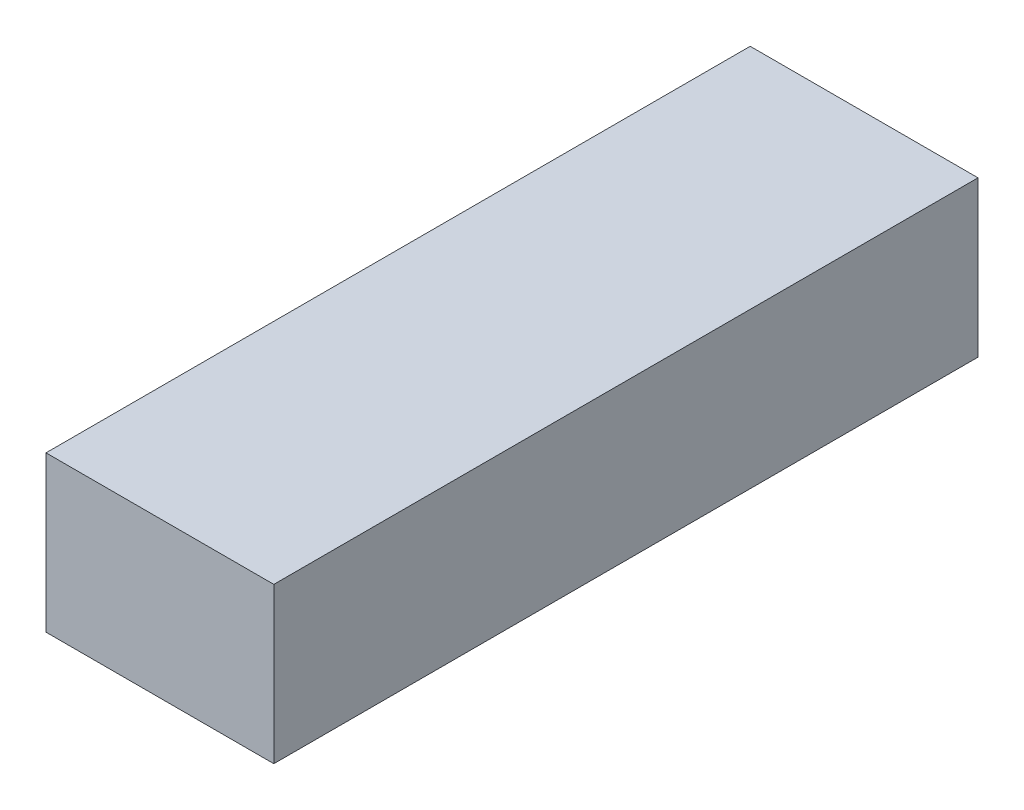
ISO-10303-21;
HEADER;
FILE_DESCRIPTION(('STEP AP214'),'2;1');
FILE_NAME('part.step','',(''),(''),'','','');
FILE_SCHEMA(('AUTOMOTIVE_DESIGN { 1 0 10303 214 1 1 1 1 }'));
ENDSEC;
DATA;
#1=APPLICATION_CONTEXT('core data for automotive mechanical design processes');
#2=APPLICATION_PROTOCOL_DEFINITION('international standard','automotive_design',2000,#1);
#3=PRODUCT_CONTEXT('',#1,'mechanical');
#4=PRODUCT('Part','Part','',(#3));
#5=PRODUCT_RELATED_PRODUCT_CATEGORY('part','',(#4));
#6=PRODUCT_DEFINITION_FORMATION('','',#4);
#7=PRODUCT_DEFINITION_CONTEXT('part definition',#1,'design');
#8=PRODUCT_DEFINITION('design','',#6,#7);
#9=PRODUCT_DEFINITION_SHAPE('','',#8);
#10=(LENGTH_UNIT() NAMED_UNIT(*) SI_UNIT(.MILLI.,.METRE.));
#11=(NAMED_UNIT(*) PLANE_ANGLE_UNIT() SI_UNIT($,.RADIAN.));
#12=(NAMED_UNIT(*) SI_UNIT($,.STERADIAN.) SOLID_ANGLE_UNIT());
#13=UNCERTAINTY_MEASURE_WITH_UNIT(LENGTH_MEASURE(1.E-05),#10,'distance_accuracy_value','');
#14=(GEOMETRIC_REPRESENTATION_CONTEXT(3) GLOBAL_UNCERTAINTY_ASSIGNED_CONTEXT((#13)) GLOBAL_UNIT_ASSIGNED_CONTEXT((#10,
#11,#12)) REPRESENTATION_CONTEXT('',''));
#15=CARTESIAN_POINT('',(0.,0.,0.));
#16=DIRECTION('',(0.,0.,1.));
#17=DIRECTION('',(1.,0.,0.));
#18=AXIS2_PLACEMENT_3D('',#15,#16,#17);
#19=CARTESIAN_POINT('',(-21.1619047619048,30.,87.6));
#20=DIRECTION('',(1.,0.,0.));
#21=DIRECTION('',(0.,0.,-1.));
#22=AXIS2_PLACEMENT_3D('',#19,#20,#21);
#23=PLANE('',#22);
#24=DIRECTION('',(0.,0.,1.));
#25=VECTOR('',#24,1.);
#26=CARTESIAN_POINT('',(-21.1619047619048,0.,87.6));
#27=LINE('',#26,#25);
#28=CARTESIAN_POINT('',(-21.1619047619048,0.,-48.4));
#29=VERTEX_POINT('',#28);
#30=CARTESIAN_POINT('',(-21.1619047619048,0.,87.6));
#31=VERTEX_POINT('',#30);
#32=EDGE_CURVE('E109',#29,#31,#27,.T.);
#33=ORIENTED_EDGE('',*,*,#32,.T.);
#34=DIRECTION('',(0.,-1.,0.));
#35=VECTOR('',#34,1.);
#36=CARTESIAN_POINT('',(-21.1619047619048,30.,87.6));
#37=LINE('',#36,#35);
#38=CARTESIAN_POINT('',(-21.1619047619048,30.,87.6));
#39=VERTEX_POINT('',#38);
#40=EDGE_CURVE('E11',#39,#31,#37,.T.);
#41=ORIENTED_EDGE('',*,*,#40,.F.);
#42=DIRECTION('',(0.,0.,1.));
#43=VECTOR('',#42,1.);
#44=CARTESIAN_POINT('',(-21.1619047619048,30.,87.6));
#45=LINE('',#44,#43);
#46=CARTESIAN_POINT('',(-21.1619047619048,30.,-48.4));
#47=VERTEX_POINT('',#46);
#48=EDGE_CURVE('E93',#47,#39,#45,.T.);
#49=ORIENTED_EDGE('',*,*,#48,.F.);
#50=DIRECTION('',(0.,-1.,0.));
#51=VECTOR('',#50,1.);
#52=CARTESIAN_POINT('',(-21.1619047619048,30.,-48.4));
#53=LINE('',#52,#51);
#54=EDGE_CURVE('E105',#47,#29,#53,.T.);
#55=ORIENTED_EDGE('',*,*,#54,.T.);
#56=EDGE_LOOP('',(#33,#41,#49,#55));
#57=FACE_BOUND('',#56,.T.);
#58=ADVANCED_FACE('F41',(#57),#23,.F.);
#59=CARTESIAN_POINT('',(-21.1619047619048,30.,87.6));
#60=DIRECTION('',(0.,0.,-1.));
#61=DIRECTION('',(-1.,0.,0.));
#62=AXIS2_PLACEMENT_3D('',#59,#60,#61);
#63=PLANE('',#62);
#64=DIRECTION('',(1.,0.,0.));
#65=VECTOR('',#64,1.);
#66=CARTESIAN_POINT('',(-21.1619047619048,0.,87.6));
#67=LINE('',#66,#65);
#68=CARTESIAN_POINT('',(22.8380952380952,0.,87.6));
#69=VERTEX_POINT('',#68);
#70=EDGE_CURVE('E98',#31,#69,#67,.T.);
#71=ORIENTED_EDGE('',*,*,#70,.T.);
#72=DIRECTION('',(0.,-1.,0.));
#73=VECTOR('',#72,1.);
#74=CARTESIAN_POINT('',(22.8380952380952,30.,87.6));
#75=LINE('',#74,#73);
#76=CARTESIAN_POINT('',(22.8380952380952,30.,87.6));
#77=VERTEX_POINT('',#76);
#78=EDGE_CURVE('E50',#77,#69,#75,.T.);
#79=ORIENTED_EDGE('',*,*,#78,.F.);
#80=DIRECTION('',(1.,0.,0.));
#81=VECTOR('',#80,1.);
#82=CARTESIAN_POINT('',(-21.1619047619048,30.,87.6));
#83=LINE('',#82,#81);
#84=EDGE_CURVE('E88',#39,#77,#83,.T.);
#85=ORIENTED_EDGE('',*,*,#84,.F.);
#86=ORIENTED_EDGE('',*,*,#40,.T.);
#87=EDGE_LOOP('',(#71,#79,#85,#86));
#88=FACE_BOUND('',#87,.T.);
#89=ADVANCED_FACE('F97',(#88),#63,.F.);
#90=CARTESIAN_POINT('',(22.8380952380952,30.,87.6));
#91=DIRECTION('',(-1.,0.,0.));
#92=DIRECTION('',(0.,0.,1.));
#93=AXIS2_PLACEMENT_3D('',#90,#91,#92);
#94=PLANE('',#93);
#95=DIRECTION('',(0.,0.,-1.));
#96=VECTOR('',#95,1.);
#97=CARTESIAN_POINT('',(22.8380952380952,0.,87.6));
#98=LINE('',#97,#96);
#99=CARTESIAN_POINT('',(22.8380952380952,0.,-48.4));
#100=VERTEX_POINT('',#99);
#101=EDGE_CURVE('E75',#69,#100,#98,.T.);
#102=ORIENTED_EDGE('',*,*,#101,.T.);
#103=DIRECTION('',(0.,-1.,0.));
#104=VECTOR('',#103,1.);
#105=CARTESIAN_POINT('',(22.8380952380952,30.,-48.4));
#106=LINE('',#105,#104);
#107=CARTESIAN_POINT('',(22.8380952380952,30.,-48.4));
#108=VERTEX_POINT('',#107);
#109=EDGE_CURVE('E100',#108,#100,#106,.T.);
#110=ORIENTED_EDGE('',*,*,#109,.F.);
#111=DIRECTION('',(0.,0.,-1.));
#112=VECTOR('',#111,1.);
#113=CARTESIAN_POINT('',(22.8380952380952,30.,87.6));
#114=LINE('',#113,#112);
#115=EDGE_CURVE('E91',#77,#108,#114,.T.);
#116=ORIENTED_EDGE('',*,*,#115,.F.);
#117=ORIENTED_EDGE('',*,*,#78,.T.);
#118=EDGE_LOOP('',(#102,#110,#116,#117));
#119=FACE_BOUND('',#118,.T.);
#120=ADVANCED_FACE('F101',(#119),#94,.F.);
#121=CARTESIAN_POINT('',(-21.1619047619048,30.,-48.4));
#122=DIRECTION('',(0.,0.,1.));
#123=DIRECTION('',(1.,0.,0.));
#124=AXIS2_PLACEMENT_3D('',#121,#122,#123);
#125=PLANE('',#124);
#126=DIRECTION('',(-1.,0.,0.));
#127=VECTOR('',#126,1.);
#128=CARTESIAN_POINT('',(-21.1619047619048,0.,-48.4));
#129=LINE('',#128,#127);
#130=EDGE_CURVE('E81',#100,#29,#129,.T.);
#131=ORIENTED_EDGE('',*,*,#130,.T.);
#132=ORIENTED_EDGE('',*,*,#54,.F.);
#133=DIRECTION('',(-1.,0.,0.));
#134=VECTOR('',#133,1.);
#135=CARTESIAN_POINT('',(-21.1619047619048,30.,-48.4));
#136=LINE('',#135,#134);
#137=EDGE_CURVE('E58',#108,#47,#136,.T.);
#138=ORIENTED_EDGE('',*,*,#137,.F.);
#139=ORIENTED_EDGE('',*,*,#109,.T.);
#140=EDGE_LOOP('',(#131,#132,#138,#139));
#141=FACE_BOUND('',#140,.T.);
#142=ADVANCED_FACE('F122',(#141),#125,.F.);
#143=CARTESIAN_POINT('',(0.,30.,0.));
#144=DIRECTION('',(0.,-1.,0.));
#145=DIRECTION('',(0.,0.,-1.));
#146=AXIS2_PLACEMENT_3D('',#143,#144,#145);
#147=PLANE('',#146);
#148=ORIENTED_EDGE('',*,*,#48,.T.);
#149=ORIENTED_EDGE('',*,*,#84,.T.);
#150=ORIENTED_EDGE('',*,*,#115,.T.);
#151=ORIENTED_EDGE('',*,*,#137,.T.);
#152=EDGE_LOOP('',(#148,#149,#150,#151));
#153=FACE_BOUND('',#152,.T.);
#154=ADVANCED_FACE('F89',(#153),#147,.F.);
#155=CARTESIAN_POINT('',(0.,0.,0.));
#156=DIRECTION('',(0.,-1.,0.));
#157=DIRECTION('',(0.,0.,-1.));
#158=AXIS2_PLACEMENT_3D('',#155,#156,#157);
#159=PLANE('',#158);
#160=ORIENTED_EDGE('',*,*,#32,.F.);
#161=ORIENTED_EDGE('',*,*,#130,.F.);
#162=ORIENTED_EDGE('',*,*,#101,.F.);
#163=ORIENTED_EDGE('',*,*,#70,.F.);
#164=EDGE_LOOP('',(#160,#161,#162,#163));
#165=FACE_BOUND('',#164,.T.);
#166=ADVANCED_FACE('F125',(#165),#159,.T.);
#167=CLOSED_SHELL('',(#58,#89,#120,#142,#154,#166));
#168=MANIFOLD_SOLID_BREP('B2',#167);
#169=ADVANCED_BREP_SHAPE_REPRESENTATION('',(#18,#168),#14);
#170=SHAPE_DEFINITION_REPRESENTATION(#9,#169);
ENDSEC;
END-ISO-10303-21;
